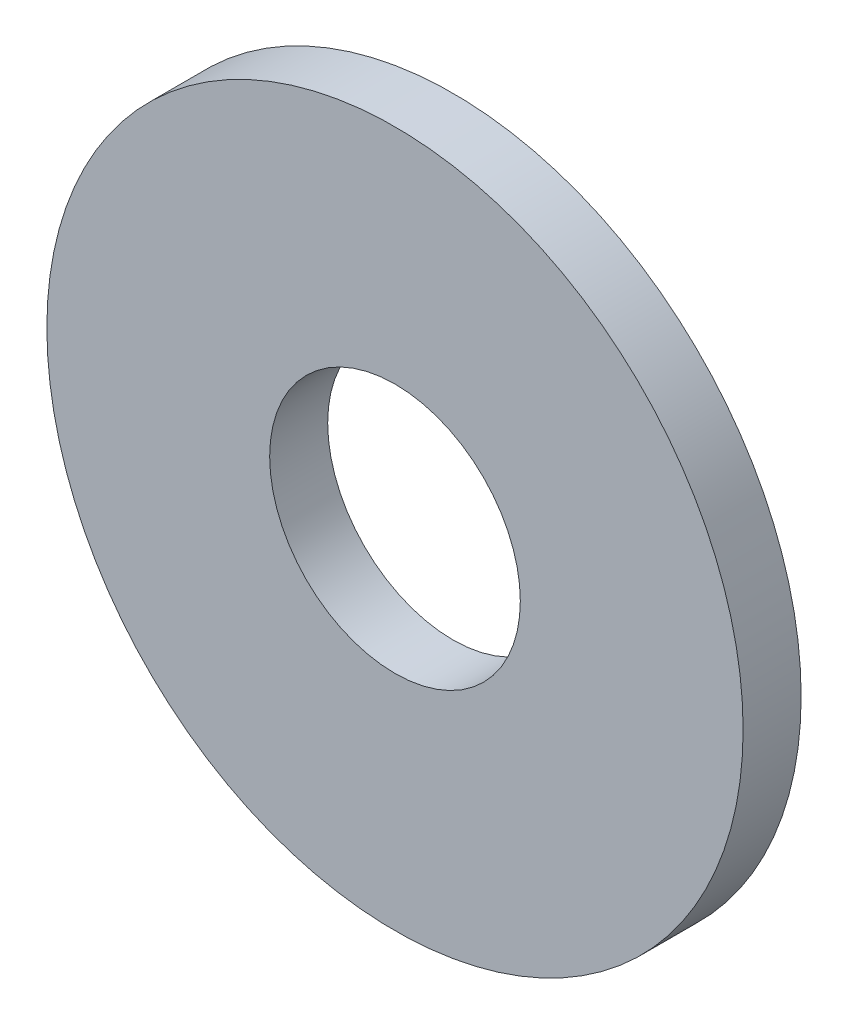
ISO-10303-21;
HEADER;
FILE_DESCRIPTION(('STEP AP214'),'2;1');
FILE_NAME('part.step','',(''),(''),'','','');
FILE_SCHEMA(('AUTOMOTIVE_DESIGN { 1 0 10303 214 1 1 1 1 }'));
ENDSEC;
DATA;
#1=APPLICATION_CONTEXT('core data for automotive mechanical design processes');
#2=APPLICATION_PROTOCOL_DEFINITION('international standard','automotive_design',2000,#1);
#3=PRODUCT_CONTEXT('',#1,'mechanical');
#4=PRODUCT('Part','Part','',(#3));
#5=PRODUCT_RELATED_PRODUCT_CATEGORY('part','',(#4));
#6=PRODUCT_DEFINITION_FORMATION('','',#4);
#7=PRODUCT_DEFINITION_CONTEXT('part definition',#1,'design');
#8=PRODUCT_DEFINITION('design','',#6,#7);
#9=PRODUCT_DEFINITION_SHAPE('','',#8);
#10=(LENGTH_UNIT() NAMED_UNIT(*) SI_UNIT(.MILLI.,.METRE.));
#11=(NAMED_UNIT(*) PLANE_ANGLE_UNIT() SI_UNIT($,.RADIAN.));
#12=(NAMED_UNIT(*) SI_UNIT($,.STERADIAN.) SOLID_ANGLE_UNIT());
#13=UNCERTAINTY_MEASURE_WITH_UNIT(LENGTH_MEASURE(1.E-05),#10,'distance_accuracy_value','');
#14=(GEOMETRIC_REPRESENTATION_CONTEXT(3) GLOBAL_UNCERTAINTY_ASSIGNED_CONTEXT((#13)) GLOBAL_UNIT_ASSIGNED_CONTEXT((#10,
#11,#12)) REPRESENTATION_CONTEXT('',''));
#15=CARTESIAN_POINT('',(0.,0.,0.));
#16=DIRECTION('',(0.,0.,1.));
#17=DIRECTION('',(1.,0.,0.));
#18=AXIS2_PLACEMENT_3D('',#15,#16,#17);
#19=CARTESIAN_POINT('',(0.,0.,1.5875));
#20=DIRECTION('',(0.,0.,1.));
#21=DIRECTION('',(1.,0.,0.));
#22=AXIS2_PLACEMENT_3D('',#19,#20,#21);
#23=PLANE('',#22);
#24=CARTESIAN_POINT('',(0.,0.,1.5875));
#25=DIRECTION('',(0.,0.,1.));
#26=DIRECTION('',(1.,0.,0.));
#27=AXIS2_PLACEMENT_3D('',#24,#25,#26);
#28=CIRCLE('',#27,9.525);
#29=CARTESIAN_POINT('',(9.525,0.,1.5875));
#30=VERTEX_POINT('',#29);
#31=EDGE_CURVE('E10',#30,#30,#28,.T.);
#32=ORIENTED_EDGE('',*,*,#31,.T.);
#33=EDGE_LOOP('',(#32));
#34=FACE_BOUND('',#33,.T.);
#35=CARTESIAN_POINT('',(0.,0.,1.5875));
#36=DIRECTION('',(0.,0.,1.));
#37=DIRECTION('',(1.,0.,0.));
#38=AXIS2_PLACEMENT_3D('',#35,#36,#37);
#39=CIRCLE('',#38,3.429);
#40=CARTESIAN_POINT('',(3.429,0.,1.5875));
#41=VERTEX_POINT('',#40);
#42=EDGE_CURVE('E41',#41,#41,#39,.T.);
#43=ORIENTED_EDGE('',*,*,#42,.F.);
#44=EDGE_LOOP('',(#43));
#45=FACE_BOUND('',#44,.T.);
#46=ADVANCED_FACE('F30',(#34,#45),#23,.T.);
#47=CARTESIAN_POINT('',(0.,0.,0.));
#48=DIRECTION('',(0.,0.,1.));
#49=DIRECTION('',(1.,0.,0.));
#50=AXIS2_PLACEMENT_3D('',#47,#48,#49);
#51=PLANE('',#50);
#52=CARTESIAN_POINT('',(0.,0.,0.));
#53=DIRECTION('',(0.,0.,1.));
#54=DIRECTION('',(1.,0.,0.));
#55=AXIS2_PLACEMENT_3D('',#52,#53,#54);
#56=CIRCLE('',#55,9.525);
#57=CARTESIAN_POINT('',(9.525,0.,0.));
#58=VERTEX_POINT('',#57);
#59=EDGE_CURVE('E34',#58,#58,#56,.T.);
#60=ORIENTED_EDGE('',*,*,#59,.F.);
#61=EDGE_LOOP('',(#60));
#62=FACE_BOUND('',#61,.T.);
#63=CARTESIAN_POINT('',(0.,0.,0.));
#64=DIRECTION('',(0.,0.,1.));
#65=DIRECTION('',(1.,0.,0.));
#66=AXIS2_PLACEMENT_3D('',#63,#64,#65);
#67=CIRCLE('',#66,3.429);
#68=CARTESIAN_POINT('',(3.429,0.,0.));
#69=VERTEX_POINT('',#68);
#70=EDGE_CURVE('E43',#69,#69,#67,.T.);
#71=ORIENTED_EDGE('',*,*,#70,.T.);
#72=EDGE_LOOP('',(#71));
#73=FACE_BOUND('',#72,.T.);
#74=ADVANCED_FACE('F53',(#62,#73),#51,.F.);
#75=CARTESIAN_POINT('',(0.,0.,1.5875));
#76=DIRECTION('',(0.,0.,-1.));
#77=DIRECTION('',(-1.,0.,0.));
#78=AXIS2_PLACEMENT_3D('',#75,#76,#77);
#79=CYLINDRICAL_SURFACE('',#78,9.525);
#80=ORIENTED_EDGE('',*,*,#31,.F.);
#81=EDGE_LOOP('',(#80));
#82=FACE_BOUND('',#81,.T.);
#83=ORIENTED_EDGE('',*,*,#59,.T.);
#84=EDGE_LOOP('',(#83));
#85=FACE_BOUND('',#84,.T.);
#86=ADVANCED_FACE('F32',(#82,#85),#79,.T.);
#87=CARTESIAN_POINT('',(0.,0.,1.5875));
#88=DIRECTION('',(0.,0.,-1.));
#89=DIRECTION('',(-1.,0.,0.));
#90=AXIS2_PLACEMENT_3D('',#87,#88,#89);
#91=CYLINDRICAL_SURFACE('',#90,3.429);
#92=ORIENTED_EDGE('',*,*,#42,.T.);
#93=EDGE_LOOP('',(#92));
#94=FACE_BOUND('',#93,.T.);
#95=ORIENTED_EDGE('',*,*,#70,.F.);
#96=EDGE_LOOP('',(#95));
#97=FACE_BOUND('',#96,.T.);
#98=ADVANCED_FACE('F49',(#94,#97),#91,.F.);
#99=CLOSED_SHELL('',(#46,#74,#86,#98));
#100=MANIFOLD_SOLID_BREP('B2',#99);
#101=ADVANCED_BREP_SHAPE_REPRESENTATION('',(#18,#100),#14);
#102=SHAPE_DEFINITION_REPRESENTATION(#9,#101);
ENDSEC;
END-ISO-10303-21;
